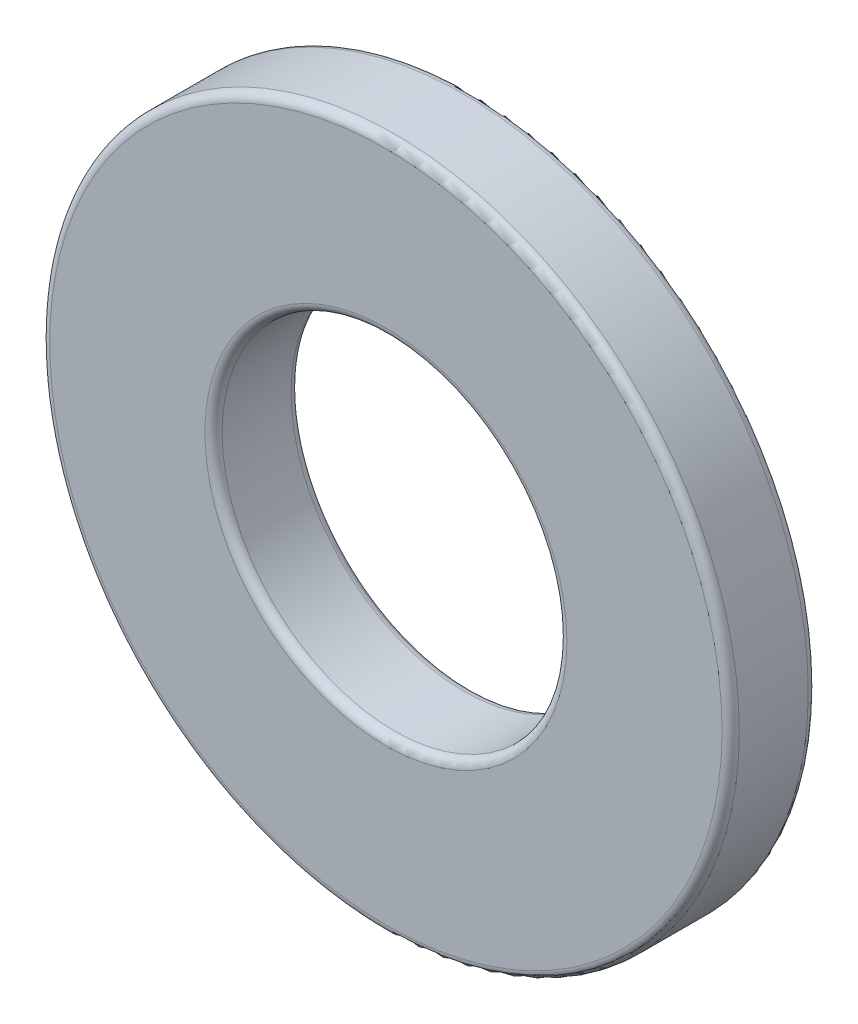
ISO-10303-21;
HEADER;
FILE_DESCRIPTION(('STEP AP214'),'2;1');
FILE_NAME('part.step','',(''),(''),'','','');
FILE_SCHEMA(('AUTOMOTIVE_DESIGN { 1 0 10303 214 1 1 1 1 }'));
ENDSEC;
DATA;
#1=APPLICATION_CONTEXT('core data for automotive mechanical design processes');
#2=APPLICATION_PROTOCOL_DEFINITION('international standard','automotive_design',2000,#1);
#3=PRODUCT_CONTEXT('',#1,'mechanical');
#4=PRODUCT('Part','Part','',(#3));
#5=PRODUCT_RELATED_PRODUCT_CATEGORY('part','',(#4));
#6=PRODUCT_DEFINITION_FORMATION('','',#4);
#7=PRODUCT_DEFINITION_CONTEXT('part definition',#1,'design');
#8=PRODUCT_DEFINITION('design','',#6,#7);
#9=PRODUCT_DEFINITION_SHAPE('','',#8);
#10=(LENGTH_UNIT() NAMED_UNIT(*) SI_UNIT(.MILLI.,.METRE.));
#11=(NAMED_UNIT(*) PLANE_ANGLE_UNIT() SI_UNIT($,.RADIAN.));
#12=(NAMED_UNIT(*) SI_UNIT($,.STERADIAN.) SOLID_ANGLE_UNIT());
#13=UNCERTAINTY_MEASURE_WITH_UNIT(LENGTH_MEASURE(1.E-05),#10,'distance_accuracy_value','');
#14=(GEOMETRIC_REPRESENTATION_CONTEXT(3) GLOBAL_UNCERTAINTY_ASSIGNED_CONTEXT((#13)) GLOBAL_UNIT_ASSIGNED_CONTEXT((#10,
#11,#12)) REPRESENTATION_CONTEXT('',''));
#15=CARTESIAN_POINT('',(0.,0.,0.));
#16=DIRECTION('',(0.,0.,1.));
#17=DIRECTION('',(1.,0.,0.));
#18=AXIS2_PLACEMENT_3D('',#15,#16,#17);
#19=CARTESIAN_POINT('',(0.,0.,0.75));
#20=DIRECTION('',(0.,0.,1.));
#21=DIRECTION('',(1.,0.,0.));
#22=AXIS2_PLACEMENT_3D('',#19,#20,#21);
#23=PLANE('',#22);
#24=CARTESIAN_POINT('',(0.,0.,0.75));
#25=DIRECTION('',(0.,0.,1.));
#26=DIRECTION('',(1.,0.,0.));
#27=AXIS2_PLACEMENT_3D('',#24,#25,#26);
#28=CIRCLE('',#27,3.15);
#29=CARTESIAN_POINT('',(3.15,0.,0.75));
#30=VERTEX_POINT('',#29);
#31=EDGE_CURVE('E10',#30,#30,#28,.F.);
#32=ORIENTED_EDGE('',*,*,#31,.T.);
#33=EDGE_LOOP('',(#32));
#34=FACE_BOUND('',#33,.T.);
#35=CARTESIAN_POINT('',(0.,0.,0.75));
#36=DIRECTION('',(0.,0.,1.));
#37=DIRECTION('',(1.,0.,0.));
#38=AXIS2_PLACEMENT_3D('',#35,#36,#37);
#39=CIRCLE('',#38,5.85);
#40=CARTESIAN_POINT('',(5.85,0.,0.75));
#41=VERTEX_POINT('',#40);
#42=EDGE_CURVE('E44',#41,#41,#39,.T.);
#43=ORIENTED_EDGE('',*,*,#42,.T.);
#44=EDGE_LOOP('',(#43));
#45=FACE_BOUND('',#44,.T.);
#46=ADVANCED_FACE('F37',(#34,#45),#23,.T.);
#47=CARTESIAN_POINT('',(0.,0.,0.75));
#48=DIRECTION('',(0.,0.,-1.));
#49=DIRECTION('',(-1.,0.,0.));
#50=AXIS2_PLACEMENT_3D('',#47,#48,#49);
#51=CYLINDRICAL_SURFACE('',#50,6.);
#52=CARTESIAN_POINT('',(0.,0.,-0.6));
#53=DIRECTION('',(0.,0.,1.));
#54=DIRECTION('',(1.,0.,0.));
#55=AXIS2_PLACEMENT_3D('',#52,#53,#54);
#56=CIRCLE('',#55,6.);
#57=CARTESIAN_POINT('',(6.,0.,-0.6));
#58=VERTEX_POINT('',#57);
#59=EDGE_CURVE('E63',#58,#58,#56,.T.);
#60=ORIENTED_EDGE('',*,*,#59,.T.);
#61=EDGE_LOOP('',(#60));
#62=FACE_BOUND('',#61,.T.);
#63=CARTESIAN_POINT('',(0.,0.,0.6));
#64=DIRECTION('',(0.,0.,1.));
#65=DIRECTION('',(1.,0.,0.));
#66=AXIS2_PLACEMENT_3D('',#63,#64,#65);
#67=CIRCLE('',#66,6.);
#68=CARTESIAN_POINT('',(6.,0.,0.6));
#69=VERTEX_POINT('',#68);
#70=EDGE_CURVE('E66',#69,#69,#67,.F.);
#71=ORIENTED_EDGE('',*,*,#70,.T.);
#72=EDGE_LOOP('',(#71));
#73=FACE_BOUND('',#72,.T.);
#74=ADVANCED_FACE('F70',(#62,#73),#51,.T.);
#75=CARTESIAN_POINT('',(0.,0.,0.75));
#76=DIRECTION('',(0.,0.,-1.));
#77=DIRECTION('',(-1.,0.,0.));
#78=AXIS2_PLACEMENT_3D('',#75,#76,#77);
#79=CYLINDRICAL_SURFACE('',#78,3.);
#80=CARTESIAN_POINT('',(0.,0.,-0.6));
#81=DIRECTION('',(0.,0.,1.));
#82=DIRECTION('',(1.,0.,0.));
#83=AXIS2_PLACEMENT_3D('',#80,#81,#82);
#84=CIRCLE('',#83,3.);
#85=CARTESIAN_POINT('',(3.,0.,-0.6));
#86=VERTEX_POINT('',#85);
#87=EDGE_CURVE('E48',#86,#86,#84,.F.);
#88=ORIENTED_EDGE('',*,*,#87,.T.);
#89=EDGE_LOOP('',(#88));
#90=FACE_BOUND('',#89,.T.);
#91=CARTESIAN_POINT('',(0.,0.,0.6));
#92=DIRECTION('',(0.,0.,1.));
#93=DIRECTION('',(1.,0.,0.));
#94=AXIS2_PLACEMENT_3D('',#91,#92,#93);
#95=CIRCLE('',#94,3.);
#96=CARTESIAN_POINT('',(3.,0.,0.6));
#97=VERTEX_POINT('',#96);
#98=EDGE_CURVE('E52',#97,#97,#95,.T.);
#99=ORIENTED_EDGE('',*,*,#98,.T.);
#100=EDGE_LOOP('',(#99));
#101=FACE_BOUND('',#100,.T.);
#102=ADVANCED_FACE('F85',(#90,#101),#79,.F.);
#103=CARTESIAN_POINT('',(0.,0.,-0.75));
#104=DIRECTION('',(0.,0.,1.));
#105=DIRECTION('',(1.,0.,0.));
#106=AXIS2_PLACEMENT_3D('',#103,#104,#105);
#107=PLANE('',#106);
#108=CARTESIAN_POINT('',(0.,0.,-0.75));
#109=DIRECTION('',(0.,0.,1.));
#110=DIRECTION('',(1.,0.,0.));
#111=AXIS2_PLACEMENT_3D('',#108,#109,#110);
#112=CIRCLE('',#111,5.85);
#113=CARTESIAN_POINT('',(5.85,0.,-0.75));
#114=VERTEX_POINT('',#113);
#115=EDGE_CURVE('E57',#114,#114,#112,.F.);
#116=ORIENTED_EDGE('',*,*,#115,.T.);
#117=EDGE_LOOP('',(#116));
#118=FACE_BOUND('',#117,.T.);
#119=CARTESIAN_POINT('',(0.,0.,-0.75));
#120=DIRECTION('',(0.,0.,1.));
#121=DIRECTION('',(1.,0.,0.));
#122=AXIS2_PLACEMENT_3D('',#119,#120,#121);
#123=CIRCLE('',#122,3.15);
#124=CARTESIAN_POINT('',(3.15,0.,-0.75));
#125=VERTEX_POINT('',#124);
#126=EDGE_CURVE('E60',#125,#125,#123,.T.);
#127=ORIENTED_EDGE('',*,*,#126,.T.);
#128=EDGE_LOOP('',(#127));
#129=FACE_BOUND('',#128,.T.);
#130=ADVANCED_FACE('F94',(#118,#129),#107,.F.);
#131=CARTESIAN_POINT('',(0.,0.,-0.6));
#132=DIRECTION('',(0.,0.,1.));
#133=DIRECTION('',(1.,0.,0.));
#134=AXIS2_PLACEMENT_3D('',#131,#132,#133);
#135=TOROIDAL_SURFACE('',#134,5.85,0.15);
#136=ORIENTED_EDGE('',*,*,#115,.F.);
#137=EDGE_LOOP('',(#136));
#138=FACE_BOUND('',#137,.T.);
#139=ORIENTED_EDGE('',*,*,#59,.F.);
#140=EDGE_LOOP('',(#139));
#141=FACE_BOUND('',#140,.T.);
#142=ADVANCED_FACE('F91',(#138,#141),#135,.T.);
#143=CARTESIAN_POINT('',(0.,0.,-0.6));
#144=DIRECTION('',(0.,0.,1.));
#145=DIRECTION('',(1.,0.,0.));
#146=AXIS2_PLACEMENT_3D('',#143,#144,#145);
#147=TOROIDAL_SURFACE('',#146,3.15,0.15);
#148=ORIENTED_EDGE('',*,*,#87,.F.);
#149=EDGE_LOOP('',(#148));
#150=FACE_BOUND('',#149,.T.);
#151=ORIENTED_EDGE('',*,*,#126,.F.);
#152=EDGE_LOOP('',(#151));
#153=FACE_BOUND('',#152,.T.);
#154=ADVANCED_FACE('F78',(#150,#153),#147,.T.);
#155=CARTESIAN_POINT('',(0.,0.,0.6));
#156=DIRECTION('',(0.,0.,1.));
#157=DIRECTION('',(1.,0.,0.));
#158=AXIS2_PLACEMENT_3D('',#155,#156,#157);
#159=TOROIDAL_SURFACE('',#158,3.15,0.15);
#160=ORIENTED_EDGE('',*,*,#31,.F.);
#161=EDGE_LOOP('',(#160));
#162=FACE_BOUND('',#161,.T.);
#163=ORIENTED_EDGE('',*,*,#98,.F.);
#164=EDGE_LOOP('',(#163));
#165=FACE_BOUND('',#164,.T.);
#166=ADVANCED_FACE('F74',(#162,#165),#159,.T.);
#167=CARTESIAN_POINT('',(0.,0.,0.6));
#168=DIRECTION('',(0.,0.,1.));
#169=DIRECTION('',(1.,0.,0.));
#170=AXIS2_PLACEMENT_3D('',#167,#168,#169);
#171=TOROIDAL_SURFACE('',#170,5.85,0.15);
#172=ORIENTED_EDGE('',*,*,#70,.F.);
#173=EDGE_LOOP('',(#172));
#174=FACE_BOUND('',#173,.T.);
#175=ORIENTED_EDGE('',*,*,#42,.F.);
#176=EDGE_LOOP('',(#175));
#177=FACE_BOUND('',#176,.T.);
#178=ADVANCED_FACE('F39',(#174,#177),#171,.T.);
#179=CLOSED_SHELL('',(#46,#74,#102,#130,#142,#154,#166,#178));
#180=MANIFOLD_SOLID_BREP('B2',#179);
#181=ADVANCED_BREP_SHAPE_REPRESENTATION('',(#18,#180),#14);
#182=SHAPE_DEFINITION_REPRESENTATION(#9,#181);
ENDSEC;
END-ISO-10303-21;
